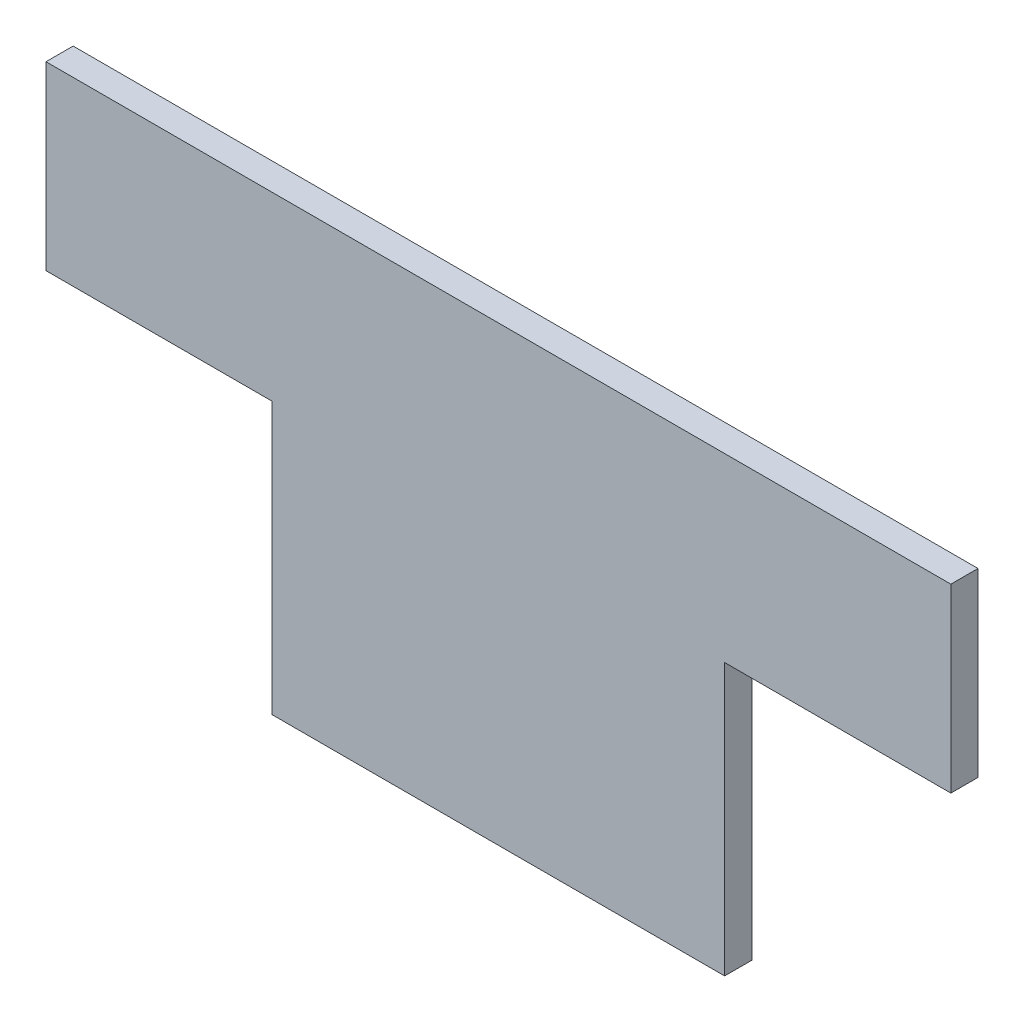
ISO-10303-21;
HEADER;
FILE_DESCRIPTION(('STEP AP214'),'2;1');
FILE_NAME('part.step','',(''),(''),'','','');
FILE_SCHEMA(('AUTOMOTIVE_DESIGN { 1 0 10303 214 1 1 1 1 }'));
ENDSEC;
DATA;
#1=APPLICATION_CONTEXT('core data for automotive mechanical design processes');
#2=APPLICATION_PROTOCOL_DEFINITION('international standard','automotive_design',2000,#1);
#3=PRODUCT_CONTEXT('',#1,'mechanical');
#4=PRODUCT('Part','Part','',(#3));
#5=PRODUCT_RELATED_PRODUCT_CATEGORY('part','',(#4));
#6=PRODUCT_DEFINITION_FORMATION('','',#4);
#7=PRODUCT_DEFINITION_CONTEXT('part definition',#1,'design');
#8=PRODUCT_DEFINITION('design','',#6,#7);
#9=PRODUCT_DEFINITION_SHAPE('','',#8);
#10=(LENGTH_UNIT() NAMED_UNIT(*) SI_UNIT(.MILLI.,.METRE.));
#11=(NAMED_UNIT(*) PLANE_ANGLE_UNIT() SI_UNIT($,.RADIAN.));
#12=(NAMED_UNIT(*) SI_UNIT($,.STERADIAN.) SOLID_ANGLE_UNIT());
#13=UNCERTAINTY_MEASURE_WITH_UNIT(LENGTH_MEASURE(1.E-05),#10,'distance_accuracy_value','');
#14=(GEOMETRIC_REPRESENTATION_CONTEXT(3) GLOBAL_UNCERTAINTY_ASSIGNED_CONTEXT((#13)) GLOBAL_UNIT_ASSIGNED_CONTEXT((#10,
#11,#12)) REPRESENTATION_CONTEXT('',''));
#15=CARTESIAN_POINT('',(0.,0.,0.));
#16=DIRECTION('',(0.,0.,1.));
#17=DIRECTION('',(1.,0.,0.));
#18=AXIS2_PLACEMENT_3D('',#15,#16,#17);
#19=CARTESIAN_POINT('',(-50.,25.,3.));
#20=DIRECTION('',(1.,0.,0.));
#21=DIRECTION('',(0.,0.,-1.));
#22=AXIS2_PLACEMENT_3D('',#19,#20,#21);
#23=PLANE('',#22);
#24=DIRECTION('',(0.,-1.,0.));
#25=VECTOR('',#24,1.);
#26=CARTESIAN_POINT('',(-50.,25.,0.));
#27=LINE('',#26,#25);
#28=CARTESIAN_POINT('',(-50.,25.,0.));
#29=VERTEX_POINT('',#28);
#30=CARTESIAN_POINT('',(-50.,5.,0.));
#31=VERTEX_POINT('',#30);
#32=EDGE_CURVE('E140',#29,#31,#27,.T.);
#33=ORIENTED_EDGE('',*,*,#32,.T.);
#34=DIRECTION('',(0.,0.,-1.));
#35=VECTOR('',#34,1.);
#36=CARTESIAN_POINT('',(-50.,5.,3.));
#37=LINE('',#36,#35);
#38=CARTESIAN_POINT('',(-50.,5.,3.));
#39=VERTEX_POINT('',#38);
#40=EDGE_CURVE('E11',#39,#31,#37,.T.);
#41=ORIENTED_EDGE('',*,*,#40,.F.);
#42=DIRECTION('',(0.,-1.,0.));
#43=VECTOR('',#42,1.);
#44=CARTESIAN_POINT('',(-50.,25.,3.));
#45=LINE('',#44,#43);
#46=CARTESIAN_POINT('',(-50.,25.,3.));
#47=VERTEX_POINT('',#46);
#48=EDGE_CURVE('E162',#47,#39,#45,.T.);
#49=ORIENTED_EDGE('',*,*,#48,.F.);
#50=DIRECTION('',(0.,0.,-1.));
#51=VECTOR('',#50,1.);
#52=CARTESIAN_POINT('',(-50.,25.,3.));
#53=LINE('',#52,#51);
#54=EDGE_CURVE('E136',#47,#29,#53,.T.);
#55=ORIENTED_EDGE('',*,*,#54,.T.);
#56=EDGE_LOOP('',(#33,#41,#49,#55));
#57=FACE_BOUND('',#56,.T.);
#58=ADVANCED_FACE('F39',(#57),#23,.F.);
#59=CARTESIAN_POINT('',(-50.,5.,3.));
#60=DIRECTION('',(0.,1.,0.));
#61=DIRECTION('',(-1.,0.,0.));
#62=AXIS2_PLACEMENT_3D('',#59,#60,#61);
#63=PLANE('',#62);
#64=DIRECTION('',(1.,0.,0.));
#65=VECTOR('',#64,1.);
#66=CARTESIAN_POINT('',(-50.,5.,0.));
#67=LINE('',#66,#65);
#68=CARTESIAN_POINT('',(-25.,5.,0.));
#69=VERTEX_POINT('',#68);
#70=EDGE_CURVE('E144',#31,#69,#67,.T.);
#71=ORIENTED_EDGE('',*,*,#70,.T.);
#72=DIRECTION('',(0.,0.,-1.));
#73=VECTOR('',#72,1.);
#74=CARTESIAN_POINT('',(-25.,5.,3.));
#75=LINE('',#74,#73);
#76=CARTESIAN_POINT('',(-25.,5.,3.));
#77=VERTEX_POINT('',#76);
#78=EDGE_CURVE('E48',#77,#69,#75,.T.);
#79=ORIENTED_EDGE('',*,*,#78,.F.);
#80=DIRECTION('',(1.,0.,0.));
#81=VECTOR('',#80,1.);
#82=CARTESIAN_POINT('',(-50.,5.,3.));
#83=LINE('',#82,#81);
#84=EDGE_CURVE('E99',#39,#77,#83,.T.);
#85=ORIENTED_EDGE('',*,*,#84,.F.);
#86=ORIENTED_EDGE('',*,*,#40,.T.);
#87=EDGE_LOOP('',(#71,#79,#85,#86));
#88=FACE_BOUND('',#87,.T.);
#89=ADVANCED_FACE('F208',(#88),#63,.F.);
#90=CARTESIAN_POINT('',(-25.,5.,3.));
#91=DIRECTION('',(1.,0.,0.));
#92=DIRECTION('',(0.,1.,0.));
#93=AXIS2_PLACEMENT_3D('',#90,#91,#92);
#94=PLANE('',#93);
#95=DIRECTION('',(0.,-1.,0.));
#96=VECTOR('',#95,1.);
#97=CARTESIAN_POINT('',(-25.,5.,0.));
#98=LINE('',#97,#96);
#99=CARTESIAN_POINT('',(-25.,-25.,0.));
#100=VERTEX_POINT('',#99);
#101=EDGE_CURVE('E147',#69,#100,#98,.T.);
#102=ORIENTED_EDGE('',*,*,#101,.T.);
#103=DIRECTION('',(0.,0.,-1.));
#104=VECTOR('',#103,1.);
#105=CARTESIAN_POINT('',(-25.,-25.,3.));
#106=LINE('',#105,#104);
#107=CARTESIAN_POINT('',(-25.,-25.,3.));
#108=VERTEX_POINT('',#107);
#109=EDGE_CURVE('E173',#108,#100,#106,.T.);
#110=ORIENTED_EDGE('',*,*,#109,.F.);
#111=DIRECTION('',(0.,-1.,0.));
#112=VECTOR('',#111,1.);
#113=CARTESIAN_POINT('',(-25.,5.,3.));
#114=LINE('',#113,#112);
#115=EDGE_CURVE('E183',#77,#108,#114,.T.);
#116=ORIENTED_EDGE('',*,*,#115,.F.);
#117=ORIENTED_EDGE('',*,*,#78,.T.);
#118=EDGE_LOOP('',(#102,#110,#116,#117));
#119=FACE_BOUND('',#118,.T.);
#120=ADVANCED_FACE('F181',(#119),#94,.F.);
#121=CARTESIAN_POINT('',(-25.,-25.,3.));
#122=DIRECTION('',(0.,1.,0.));
#123=DIRECTION('',(-1.,0.,0.));
#124=AXIS2_PLACEMENT_3D('',#121,#122,#123);
#125=PLANE('',#124);
#126=DIRECTION('',(1.,0.,0.));
#127=VECTOR('',#126,1.);
#128=CARTESIAN_POINT('',(-25.,-25.,0.));
#129=LINE('',#128,#127);
#130=CARTESIAN_POINT('',(25.,-25.,0.));
#131=VERTEX_POINT('',#130);
#132=EDGE_CURVE('E150',#100,#131,#129,.T.);
#133=ORIENTED_EDGE('',*,*,#132,.T.);
#134=DIRECTION('',(0.,0.,-1.));
#135=VECTOR('',#134,1.);
#136=CARTESIAN_POINT('',(25.,-25.,3.));
#137=LINE('',#136,#135);
#138=CARTESIAN_POINT('',(25.,-25.,3.));
#139=VERTEX_POINT('',#138);
#140=EDGE_CURVE('E169',#139,#131,#137,.T.);
#141=ORIENTED_EDGE('',*,*,#140,.F.);
#142=DIRECTION('',(1.,0.,0.));
#143=VECTOR('',#142,1.);
#144=CARTESIAN_POINT('',(-25.,-25.,3.));
#145=LINE('',#144,#143);
#146=EDGE_CURVE('E196',#108,#139,#145,.T.);
#147=ORIENTED_EDGE('',*,*,#146,.F.);
#148=ORIENTED_EDGE('',*,*,#109,.T.);
#149=EDGE_LOOP('',(#133,#141,#147,#148));
#150=FACE_BOUND('',#149,.T.);
#151=ADVANCED_FACE('F191',(#150),#125,.F.);
#152=CARTESIAN_POINT('',(25.,5.00000000000001,3.));
#153=DIRECTION('',(-1.,0.,0.));
#154=DIRECTION('',(0.,-1.,0.));
#155=AXIS2_PLACEMENT_3D('',#152,#153,#154);
#156=PLANE('',#155);
#157=DIRECTION('',(0.,1.,0.));
#158=VECTOR('',#157,1.);
#159=CARTESIAN_POINT('',(25.,5.00000000000001,0.));
#160=LINE('',#159,#158);
#161=CARTESIAN_POINT('',(25.,5.00000000000001,0.));
#162=VERTEX_POINT('',#161);
#163=EDGE_CURVE('E153',#131,#162,#160,.T.);
#164=ORIENTED_EDGE('',*,*,#163,.T.);
#165=DIRECTION('',(0.,0.,-1.));
#166=VECTOR('',#165,1.);
#167=CARTESIAN_POINT('',(25.,5.00000000000001,3.));
#168=LINE('',#167,#166);
#169=CARTESIAN_POINT('',(25.,5.00000000000001,3.));
#170=VERTEX_POINT('',#169);
#171=EDGE_CURVE('E129',#170,#162,#168,.T.);
#172=ORIENTED_EDGE('',*,*,#171,.F.);
#173=DIRECTION('',(0.,1.,0.));
#174=VECTOR('',#173,1.);
#175=CARTESIAN_POINT('',(25.,5.00000000000001,3.));
#176=LINE('',#175,#174);
#177=EDGE_CURVE('E118',#139,#170,#176,.T.);
#178=ORIENTED_EDGE('',*,*,#177,.F.);
#179=ORIENTED_EDGE('',*,*,#140,.T.);
#180=EDGE_LOOP('',(#164,#172,#178,#179));
#181=FACE_BOUND('',#180,.T.);
#182=ADVANCED_FACE('F194',(#181),#156,.F.);
#183=CARTESIAN_POINT('',(25.,5.00000000000001,3.));
#184=DIRECTION('',(0.,1.,0.));
#185=DIRECTION('',(-1.,0.,0.));
#186=AXIS2_PLACEMENT_3D('',#183,#184,#185);
#187=PLANE('',#186);
#188=DIRECTION('',(1.,0.,0.));
#189=VECTOR('',#188,1.);
#190=CARTESIAN_POINT('',(25.,5.00000000000001,0.));
#191=LINE('',#190,#189);
#192=CARTESIAN_POINT('',(50.,5.00000000000001,0.));
#193=VERTEX_POINT('',#192);
#194=EDGE_CURVE('E127',#162,#193,#191,.T.);
#195=ORIENTED_EDGE('',*,*,#194,.T.);
#196=DIRECTION('',(0.,0.,-1.));
#197=VECTOR('',#196,1.);
#198=CARTESIAN_POINT('',(50.,5.00000000000001,3.));
#199=LINE('',#198,#197);
#200=CARTESIAN_POINT('',(50.,5.00000000000001,3.));
#201=VERTEX_POINT('',#200);
#202=EDGE_CURVE('E124',#201,#193,#199,.T.);
#203=ORIENTED_EDGE('',*,*,#202,.F.);
#204=DIRECTION('',(1.,0.,0.));
#205=VECTOR('',#204,1.);
#206=CARTESIAN_POINT('',(25.,5.00000000000001,3.));
#207=LINE('',#206,#205);
#208=EDGE_CURVE('E112',#170,#201,#207,.T.);
#209=ORIENTED_EDGE('',*,*,#208,.F.);
#210=ORIENTED_EDGE('',*,*,#171,.T.);
#211=EDGE_LOOP('',(#195,#203,#209,#210));
#212=FACE_BOUND('',#211,.T.);
#213=ADVANCED_FACE('F125',(#212),#187,.F.);
#214=CARTESIAN_POINT('',(50.,25.,3.));
#215=DIRECTION('',(-1.,0.,0.));
#216=DIRECTION('',(0.,0.,1.));
#217=AXIS2_PLACEMENT_3D('',#214,#215,#216);
#218=PLANE('',#217);
#219=DIRECTION('',(0.,1.,0.));
#220=VECTOR('',#219,1.);
#221=CARTESIAN_POINT('',(50.,25.,0.));
#222=LINE('',#221,#220);
#223=CARTESIAN_POINT('',(50.,25.,0.));
#224=VERTEX_POINT('',#223);
#225=EDGE_CURVE('E85',#193,#224,#222,.T.);
#226=ORIENTED_EDGE('',*,*,#225,.T.);
#227=DIRECTION('',(0.,0.,-1.));
#228=VECTOR('',#227,1.);
#229=CARTESIAN_POINT('',(50.,25.,3.));
#230=LINE('',#229,#228);
#231=CARTESIAN_POINT('',(50.,25.,3.));
#232=VERTEX_POINT('',#231);
#233=EDGE_CURVE('E130',#232,#224,#230,.T.);
#234=ORIENTED_EDGE('',*,*,#233,.F.);
#235=DIRECTION('',(0.,1.,0.));
#236=VECTOR('',#235,1.);
#237=CARTESIAN_POINT('',(50.,25.,3.));
#238=LINE('',#237,#236);
#239=EDGE_CURVE('E116',#201,#232,#238,.T.);
#240=ORIENTED_EDGE('',*,*,#239,.F.);
#241=ORIENTED_EDGE('',*,*,#202,.T.);
#242=EDGE_LOOP('',(#226,#234,#240,#241));
#243=FACE_BOUND('',#242,.T.);
#244=ADVANCED_FACE('F132',(#243),#218,.F.);
#245=CARTESIAN_POINT('',(-50.,25.,3.));
#246=DIRECTION('',(0.,-1.,0.));
#247=DIRECTION('',(0.,0.,-1.));
#248=AXIS2_PLACEMENT_3D('',#245,#246,#247);
#249=PLANE('',#248);
#250=DIRECTION('',(-1.,0.,0.));
#251=VECTOR('',#250,1.);
#252=CARTESIAN_POINT('',(-50.,25.,0.));
#253=LINE('',#252,#251);
#254=EDGE_CURVE('E91',#224,#29,#253,.T.);
#255=ORIENTED_EDGE('',*,*,#254,.T.);
#256=ORIENTED_EDGE('',*,*,#54,.F.);
#257=DIRECTION('',(-1.,0.,0.));
#258=VECTOR('',#257,1.);
#259=CARTESIAN_POINT('',(-50.,25.,3.));
#260=LINE('',#259,#258);
#261=EDGE_CURVE('E56',#232,#47,#260,.T.);
#262=ORIENTED_EDGE('',*,*,#261,.F.);
#263=ORIENTED_EDGE('',*,*,#233,.T.);
#264=EDGE_LOOP('',(#255,#256,#262,#263));
#265=FACE_BOUND('',#264,.T.);
#266=ADVANCED_FACE('F224',(#265),#249,.F.);
#267=CARTESIAN_POINT('',(0.,0.,3.));
#268=DIRECTION('',(0.,0.,1.));
#269=DIRECTION('',(1.,0.,0.));
#270=AXIS2_PLACEMENT_3D('',#267,#268,#269);
#271=PLANE('',#270);
#272=ORIENTED_EDGE('',*,*,#48,.T.);
#273=ORIENTED_EDGE('',*,*,#84,.T.);
#274=ORIENTED_EDGE('',*,*,#115,.T.);
#275=ORIENTED_EDGE('',*,*,#146,.T.);
#276=ORIENTED_EDGE('',*,*,#177,.T.);
#277=ORIENTED_EDGE('',*,*,#208,.T.);
#278=ORIENTED_EDGE('',*,*,#239,.T.);
#279=ORIENTED_EDGE('',*,*,#261,.T.);
#280=EDGE_LOOP('',(#272,#273,#274,#275,#276,#277,#278,#279));
#281=FACE_BOUND('',#280,.T.);
#282=ADVANCED_FACE('F114',(#281),#271,.T.);
#283=CARTESIAN_POINT('',(0.,0.,0.));
#284=DIRECTION('',(0.,0.,1.));
#285=DIRECTION('',(1.,0.,0.));
#286=AXIS2_PLACEMENT_3D('',#283,#284,#285);
#287=PLANE('',#286);
#288=ORIENTED_EDGE('',*,*,#32,.F.);
#289=ORIENTED_EDGE('',*,*,#254,.F.);
#290=ORIENTED_EDGE('',*,*,#225,.F.);
#291=ORIENTED_EDGE('',*,*,#194,.F.);
#292=ORIENTED_EDGE('',*,*,#163,.F.);
#293=ORIENTED_EDGE('',*,*,#132,.F.);
#294=ORIENTED_EDGE('',*,*,#101,.F.);
#295=ORIENTED_EDGE('',*,*,#70,.F.);
#296=EDGE_LOOP('',(#288,#289,#290,#291,#292,#293,#294,#295));
#297=FACE_BOUND('',#296,.T.);
#298=ADVANCED_FACE('F187',(#297),#287,.F.);
#299=CLOSED_SHELL('',(#58,#89,#120,#151,#182,#213,#244,#266,#282,#298));
#300=MANIFOLD_SOLID_BREP('B2',#299);
#301=ADVANCED_BREP_SHAPE_REPRESENTATION('',(#18,#300),#14);
#302=SHAPE_DEFINITION_REPRESENTATION(#9,#301);
ENDSEC;
END-ISO-10303-21;
